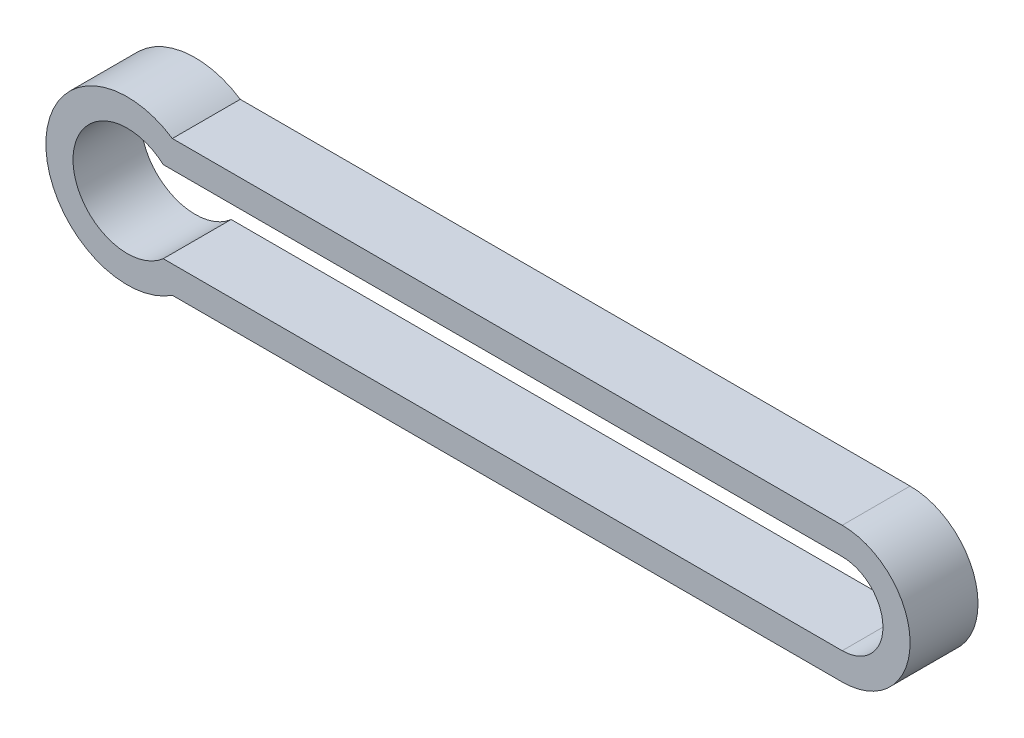
ISO-10303-21;
HEADER;
FILE_DESCRIPTION(('STEP AP214'),'2;1');
FILE_NAME('part.step','',(''),(''),'','','');
FILE_SCHEMA(('AUTOMOTIVE_DESIGN { 1 0 10303 214 1 1 1 1 }'));
ENDSEC;
DATA;
#1=APPLICATION_CONTEXT('core data for automotive mechanical design processes');
#2=APPLICATION_PROTOCOL_DEFINITION('international standard','automotive_design',2000,#1);
#3=PRODUCT_CONTEXT('',#1,'mechanical');
#4=PRODUCT('Part','Part','',(#3));
#5=PRODUCT_RELATED_PRODUCT_CATEGORY('part','',(#4));
#6=PRODUCT_DEFINITION_FORMATION('','',#4);
#7=PRODUCT_DEFINITION_CONTEXT('part definition',#1,'design');
#8=PRODUCT_DEFINITION('design','',#6,#7);
#9=PRODUCT_DEFINITION_SHAPE('','',#8);
#10=(LENGTH_UNIT() NAMED_UNIT(*) SI_UNIT(.MILLI.,.METRE.));
#11=(NAMED_UNIT(*) PLANE_ANGLE_UNIT() SI_UNIT($,.RADIAN.));
#12=(NAMED_UNIT(*) SI_UNIT($,.STERADIAN.) SOLID_ANGLE_UNIT());
#13=UNCERTAINTY_MEASURE_WITH_UNIT(LENGTH_MEASURE(1.E-05),#10,'distance_accuracy_value','');
#14=(GEOMETRIC_REPRESENTATION_CONTEXT(3) GLOBAL_UNCERTAINTY_ASSIGNED_CONTEXT((#13)) GLOBAL_UNIT_ASSIGNED_CONTEXT((#10,
#11,#12)) REPRESENTATION_CONTEXT('',''));
#15=CARTESIAN_POINT('',(0.,0.,0.));
#16=DIRECTION('',(0.,0.,1.));
#17=DIRECTION('',(1.,0.,0.));
#18=AXIS2_PLACEMENT_3D('',#15,#16,#17);
#19=CARTESIAN_POINT('',(52.6457513110646,0.,5.));
#20=DIRECTION('',(0.,0.,1.));
#21=DIRECTION('',(1.,0.,0.));
#22=AXIS2_PLACEMENT_3D('',#19,#20,#21);
#23=PLANE('',#22);
#24=CARTESIAN_POINT('',(52.6457513110646,0.,5.));
#25=DIRECTION('',(0.,0.,1.));
#26=DIRECTION('',(1.,0.,0.));
#27=AXIS2_PLACEMENT_3D('',#24,#25,#26);
#28=CIRCLE('',#27,5.);
#29=CARTESIAN_POINT('',(52.6457513110646,-5.,5.));
#30=VERTEX_POINT('',#29);
#31=CARTESIAN_POINT('',(52.6457513110646,5.,5.));
#32=VERTEX_POINT('',#31);
#33=EDGE_CURVE('E153',#30,#32,#28,.T.);
#34=ORIENTED_EDGE('',*,*,#33,.T.);
#35=DIRECTION('',(-1.,0.,0.));
#36=VECTOR('',#35,1.);
#37=CARTESIAN_POINT('',(52.6457513110646,5.,5.));
#38=LINE('',#37,#36);
#39=CARTESIAN_POINT('',(3.31662479035541,5.,5.));
#40=VERTEX_POINT('',#39);
#41=EDGE_CURVE('E157',#32,#40,#38,.T.);
#42=ORIENTED_EDGE('',*,*,#41,.T.);
#43=CARTESIAN_POINT('',(0.,0.,5.));
#44=DIRECTION('',(0.,0.,1.));
#45=DIRECTION('',(1.,0.,0.));
#46=AXIS2_PLACEMENT_3D('',#43,#44,#45);
#47=CIRCLE('',#46,6.);
#48=CARTESIAN_POINT('',(3.31662479035541,-5.,5.));
#49=VERTEX_POINT('',#48);
#50=EDGE_CURVE('E161',#40,#49,#47,.T.);
#51=ORIENTED_EDGE('',*,*,#50,.T.);
#52=DIRECTION('',(1.,0.,0.));
#53=VECTOR('',#52,1.);
#54=CARTESIAN_POINT('',(52.6457513110646,-5.,5.));
#55=LINE('',#54,#53);
#56=EDGE_CURVE('E164',#49,#30,#55,.T.);
#57=ORIENTED_EDGE('',*,*,#56,.T.);
#58=EDGE_LOOP('',(#34,#42,#51,#57));
#59=FACE_BOUND('',#58,.T.);
#60=DIRECTION('',(-1.,0.,0.));
#61=VECTOR('',#60,1.);
#62=CARTESIAN_POINT('',(2.64575131106459,3.,5.));
#63=LINE('',#62,#61);
#64=CARTESIAN_POINT('',(52.6457513110646,3.,5.));
#65=VERTEX_POINT('',#64);
#66=CARTESIAN_POINT('',(2.64575131106459,3.,5.));
#67=VERTEX_POINT('',#66);
#68=EDGE_CURVE('E114',#65,#67,#63,.T.);
#69=ORIENTED_EDGE('',*,*,#68,.F.);
#70=CARTESIAN_POINT('',(52.6457513110646,0.,5.));
#71=DIRECTION('',(0.,0.,1.));
#72=DIRECTION('',(1.,0.,0.));
#73=AXIS2_PLACEMENT_3D('',#70,#71,#72);
#74=CIRCLE('',#73,3.);
#75=CARTESIAN_POINT('',(52.6457513110646,-3.,5.));
#76=VERTEX_POINT('',#75);
#77=EDGE_CURVE('E105',#76,#65,#74,.T.);
#78=ORIENTED_EDGE('',*,*,#77,.F.);
#79=DIRECTION('',(1.,0.,0.));
#80=VECTOR('',#79,1.);
#81=CARTESIAN_POINT('',(2.64575131106459,-3.,5.));
#82=LINE('',#81,#80);
#83=CARTESIAN_POINT('',(2.64575131106459,-3.,5.));
#84=VERTEX_POINT('',#83);
#85=EDGE_CURVE('E131',#84,#76,#82,.T.);
#86=ORIENTED_EDGE('',*,*,#85,.F.);
#87=CARTESIAN_POINT('',(0.,0.,5.));
#88=DIRECTION('',(0.,0.,1.));
#89=DIRECTION('',(1.,0.,0.));
#90=AXIS2_PLACEMENT_3D('',#87,#88,#89);
#91=CIRCLE('',#90,4.);
#92=EDGE_CURVE('E127',#67,#84,#91,.T.);
#93=ORIENTED_EDGE('',*,*,#92,.F.);
#94=EDGE_LOOP('',(#69,#78,#86,#93));
#95=FACE_BOUND('',#94,.T.);
#96=ADVANCED_FACE('F39',(#59,#95),#23,.T.);
#97=CARTESIAN_POINT('',(52.6457513110646,0.,0.));
#98=DIRECTION('',(0.,0.,1.));
#99=DIRECTION('',(1.,0.,0.));
#100=AXIS2_PLACEMENT_3D('',#97,#98,#99);
#101=PLANE('',#100);
#102=CARTESIAN_POINT('',(52.6457513110646,0.,0.));
#103=DIRECTION('',(0.,0.,1.));
#104=DIRECTION('',(1.,0.,0.));
#105=AXIS2_PLACEMENT_3D('',#102,#103,#104);
#106=CIRCLE('',#105,5.);
#107=CARTESIAN_POINT('',(52.6457513110646,-5.,0.));
#108=VERTEX_POINT('',#107);
#109=CARTESIAN_POINT('',(52.6457513110646,5.,0.));
#110=VERTEX_POINT('',#109);
#111=EDGE_CURVE('E123',#108,#110,#106,.T.);
#112=ORIENTED_EDGE('',*,*,#111,.F.);
#113=DIRECTION('',(1.,0.,0.));
#114=VECTOR('',#113,1.);
#115=CARTESIAN_POINT('',(52.6457513110646,-5.,0.));
#116=LINE('',#115,#114);
#117=CARTESIAN_POINT('',(3.31662479035541,-5.,0.));
#118=VERTEX_POINT('',#117);
#119=EDGE_CURVE('E158',#118,#108,#116,.T.);
#120=ORIENTED_EDGE('',*,*,#119,.F.);
#121=CARTESIAN_POINT('',(0.,0.,0.));
#122=DIRECTION('',(0.,0.,1.));
#123=DIRECTION('',(1.,0.,0.));
#124=AXIS2_PLACEMENT_3D('',#121,#122,#123);
#125=CIRCLE('',#124,6.);
#126=CARTESIAN_POINT('',(3.31662479035541,5.,0.));
#127=VERTEX_POINT('',#126);
#128=EDGE_CURVE('E174',#127,#118,#125,.T.);
#129=ORIENTED_EDGE('',*,*,#128,.F.);
#130=DIRECTION('',(-1.,0.,0.));
#131=VECTOR('',#130,1.);
#132=CARTESIAN_POINT('',(52.6457513110646,5.,0.));
#133=LINE('',#132,#131);
#134=EDGE_CURVE('E171',#110,#127,#133,.T.);
#135=ORIENTED_EDGE('',*,*,#134,.F.);
#136=EDGE_LOOP('',(#112,#120,#129,#135));
#137=FACE_BOUND('',#136,.T.);
#138=CARTESIAN_POINT('',(52.6457513110646,0.,0.));
#139=DIRECTION('',(0.,0.,1.));
#140=DIRECTION('',(1.,0.,0.));
#141=AXIS2_PLACEMENT_3D('',#138,#139,#140);
#142=CIRCLE('',#141,3.);
#143=CARTESIAN_POINT('',(52.6457513110646,-3.,0.));
#144=VERTEX_POINT('',#143);
#145=CARTESIAN_POINT('',(52.6457513110646,3.,0.));
#146=VERTEX_POINT('',#145);
#147=EDGE_CURVE('E63',#144,#146,#142,.T.);
#148=ORIENTED_EDGE('',*,*,#147,.T.);
#149=DIRECTION('',(-1.,0.,0.));
#150=VECTOR('',#149,1.);
#151=CARTESIAN_POINT('',(2.64575131106459,3.,0.));
#152=LINE('',#151,#150);
#153=CARTESIAN_POINT('',(2.64575131106459,3.,0.));
#154=VERTEX_POINT('',#153);
#155=EDGE_CURVE('E121',#146,#154,#152,.T.);
#156=ORIENTED_EDGE('',*,*,#155,.T.);
#157=CARTESIAN_POINT('',(0.,0.,0.));
#158=DIRECTION('',(0.,0.,1.));
#159=DIRECTION('',(1.,0.,0.));
#160=AXIS2_PLACEMENT_3D('',#157,#158,#159);
#161=CIRCLE('',#160,4.);
#162=CARTESIAN_POINT('',(2.64575131106459,-3.,0.));
#163=VERTEX_POINT('',#162);
#164=EDGE_CURVE('E140',#154,#163,#161,.T.);
#165=ORIENTED_EDGE('',*,*,#164,.T.);
#166=DIRECTION('',(1.,0.,0.));
#167=VECTOR('',#166,1.);
#168=CARTESIAN_POINT('',(2.64575131106459,-3.,0.));
#169=LINE('',#168,#167);
#170=EDGE_CURVE('E115',#163,#144,#169,.T.);
#171=ORIENTED_EDGE('',*,*,#170,.T.);
#172=EDGE_LOOP('',(#148,#156,#165,#171));
#173=FACE_BOUND('',#172,.T.);
#174=ADVANCED_FACE('F197',(#137,#173),#101,.F.);
#175=CARTESIAN_POINT('',(52.6457513110646,0.,5.));
#176=DIRECTION('',(0.,0.,-1.));
#177=DIRECTION('',(-1.,0.,0.));
#178=AXIS2_PLACEMENT_3D('',#175,#176,#177);
#179=CYLINDRICAL_SURFACE('',#178,5.);
#180=ORIENTED_EDGE('',*,*,#111,.T.);
#181=DIRECTION('',(0.,0.,-1.));
#182=VECTOR('',#181,1.);
#183=CARTESIAN_POINT('',(52.6457513110646,5.,5.));
#184=LINE('',#183,#182);
#185=EDGE_CURVE('E11',#32,#110,#184,.T.);
#186=ORIENTED_EDGE('',*,*,#185,.F.);
#187=ORIENTED_EDGE('',*,*,#33,.F.);
#188=DIRECTION('',(0.,0.,-1.));
#189=VECTOR('',#188,1.);
#190=CARTESIAN_POINT('',(52.6457513110646,-5.,5.));
#191=LINE('',#190,#189);
#192=EDGE_CURVE('E167',#30,#108,#191,.T.);
#193=ORIENTED_EDGE('',*,*,#192,.T.);
#194=EDGE_LOOP('',(#180,#186,#187,#193));
#195=FACE_BOUND('',#194,.T.);
#196=ADVANCED_FACE('F41',(#195),#179,.T.);
#197=CARTESIAN_POINT('',(52.6457513110646,5.,5.));
#198=DIRECTION('',(0.,-1.,0.));
#199=DIRECTION('',(0.,0.,-1.));
#200=AXIS2_PLACEMENT_3D('',#197,#198,#199);
#201=PLANE('',#200);
#202=ORIENTED_EDGE('',*,*,#134,.T.);
#203=DIRECTION('',(0.,0.,-1.));
#204=VECTOR('',#203,1.);
#205=CARTESIAN_POINT('',(3.31662479035541,5.,5.));
#206=LINE('',#205,#204);
#207=EDGE_CURVE('E48',#40,#127,#206,.T.);
#208=ORIENTED_EDGE('',*,*,#207,.F.);
#209=ORIENTED_EDGE('',*,*,#41,.F.);
#210=ORIENTED_EDGE('',*,*,#185,.T.);
#211=EDGE_LOOP('',(#202,#208,#209,#210));
#212=FACE_BOUND('',#211,.T.);
#213=ADVANCED_FACE('F207',(#212),#201,.F.);
#214=CARTESIAN_POINT('',(0.,0.,5.));
#215=DIRECTION('',(0.,0.,-1.));
#216=DIRECTION('',(-1.,0.,0.));
#217=AXIS2_PLACEMENT_3D('',#214,#215,#216);
#218=CYLINDRICAL_SURFACE('',#217,6.);
#219=ORIENTED_EDGE('',*,*,#128,.T.);
#220=DIRECTION('',(0.,0.,-1.));
#221=VECTOR('',#220,1.);
#222=CARTESIAN_POINT('',(3.31662479035541,-5.,5.));
#223=LINE('',#222,#221);
#224=EDGE_CURVE('E182',#49,#118,#223,.T.);
#225=ORIENTED_EDGE('',*,*,#224,.F.);
#226=ORIENTED_EDGE('',*,*,#50,.F.);
#227=ORIENTED_EDGE('',*,*,#207,.T.);
#228=EDGE_LOOP('',(#219,#225,#226,#227));
#229=FACE_BOUND('',#228,.T.);
#230=ADVANCED_FACE('F191',(#229),#218,.T.);
#231=CARTESIAN_POINT('',(52.6457513110646,-5.,5.));
#232=DIRECTION('',(0.,1.,0.));
#233=DIRECTION('',(0.,0.,1.));
#234=AXIS2_PLACEMENT_3D('',#231,#232,#233);
#235=PLANE('',#234);
#236=ORIENTED_EDGE('',*,*,#119,.T.);
#237=ORIENTED_EDGE('',*,*,#192,.F.);
#238=ORIENTED_EDGE('',*,*,#56,.F.);
#239=ORIENTED_EDGE('',*,*,#224,.T.);
#240=EDGE_LOOP('',(#236,#237,#238,#239));
#241=FACE_BOUND('',#240,.T.);
#242=ADVANCED_FACE('F201',(#241),#235,.F.);
#243=CARTESIAN_POINT('',(52.6457513110646,0.,5.));
#244=DIRECTION('',(0.,0.,-1.));
#245=DIRECTION('',(-1.,0.,0.));
#246=AXIS2_PLACEMENT_3D('',#243,#244,#245);
#247=CYLINDRICAL_SURFACE('',#246,3.);
#248=ORIENTED_EDGE('',*,*,#147,.F.);
#249=DIRECTION('',(0.,0.,-1.));
#250=VECTOR('',#249,1.);
#251=CARTESIAN_POINT('',(52.6457513110646,-3.,5.));
#252=LINE('',#251,#250);
#253=EDGE_CURVE('E109',#76,#144,#252,.T.);
#254=ORIENTED_EDGE('',*,*,#253,.F.);
#255=ORIENTED_EDGE('',*,*,#77,.T.);
#256=DIRECTION('',(0.,0.,-1.));
#257=VECTOR('',#256,1.);
#258=CARTESIAN_POINT('',(52.6457513110646,3.,5.));
#259=LINE('',#258,#257);
#260=EDGE_CURVE('E108',#65,#146,#259,.T.);
#261=ORIENTED_EDGE('',*,*,#260,.T.);
#262=EDGE_LOOP('',(#248,#254,#255,#261));
#263=FACE_BOUND('',#262,.T.);
#264=ADVANCED_FACE('F107',(#263),#247,.F.);
#265=CARTESIAN_POINT('',(2.64575131106459,3.,5.));
#266=DIRECTION('',(0.,-1.,0.));
#267=DIRECTION('',(0.,0.,-1.));
#268=AXIS2_PLACEMENT_3D('',#265,#266,#267);
#269=PLANE('',#268);
#270=ORIENTED_EDGE('',*,*,#155,.F.);
#271=ORIENTED_EDGE('',*,*,#260,.F.);
#272=ORIENTED_EDGE('',*,*,#68,.T.);
#273=DIRECTION('',(0.,0.,-1.));
#274=VECTOR('',#273,1.);
#275=CARTESIAN_POINT('',(2.64575131106459,3.,5.));
#276=LINE('',#275,#274);
#277=EDGE_CURVE('E124',#67,#154,#276,.T.);
#278=ORIENTED_EDGE('',*,*,#277,.T.);
#279=EDGE_LOOP('',(#270,#271,#272,#278));
#280=FACE_BOUND('',#279,.T.);
#281=ADVANCED_FACE('F118',(#280),#269,.T.);
#282=CARTESIAN_POINT('',(0.,0.,5.));
#283=DIRECTION('',(0.,0.,-1.));
#284=DIRECTION('',(-1.,0.,0.));
#285=AXIS2_PLACEMENT_3D('',#282,#283,#284);
#286=CYLINDRICAL_SURFACE('',#285,4.);
#287=ORIENTED_EDGE('',*,*,#164,.F.);
#288=ORIENTED_EDGE('',*,*,#277,.F.);
#289=ORIENTED_EDGE('',*,*,#92,.T.);
#290=DIRECTION('',(0.,0.,-1.));
#291=VECTOR('',#290,1.);
#292=CARTESIAN_POINT('',(2.64575131106459,-3.,5.));
#293=LINE('',#292,#291);
#294=EDGE_CURVE('E55',#84,#163,#293,.T.);
#295=ORIENTED_EDGE('',*,*,#294,.T.);
#296=EDGE_LOOP('',(#287,#288,#289,#295));
#297=FACE_BOUND('',#296,.T.);
#298=ADVANCED_FACE('F230',(#297),#286,.F.);
#299=CARTESIAN_POINT('',(2.64575131106459,-3.,5.));
#300=DIRECTION('',(0.,1.,0.));
#301=DIRECTION('',(0.,0.,1.));
#302=AXIS2_PLACEMENT_3D('',#299,#300,#301);
#303=PLANE('',#302);
#304=ORIENTED_EDGE('',*,*,#170,.F.);
#305=ORIENTED_EDGE('',*,*,#294,.F.);
#306=ORIENTED_EDGE('',*,*,#85,.T.);
#307=ORIENTED_EDGE('',*,*,#253,.T.);
#308=EDGE_LOOP('',(#304,#305,#306,#307));
#309=FACE_BOUND('',#308,.T.);
#310=ADVANCED_FACE('F234',(#309),#303,.T.);
#311=CLOSED_SHELL('',(#96,#174,#196,#213,#230,#242,#264,#281,#298,#310));
#312=MANIFOLD_SOLID_BREP('B2',#311);
#313=ADVANCED_BREP_SHAPE_REPRESENTATION('',(#18,#312),#14);
#314=SHAPE_DEFINITION_REPRESENTATION(#9,#313);
ENDSEC;
END-ISO-10303-21;
